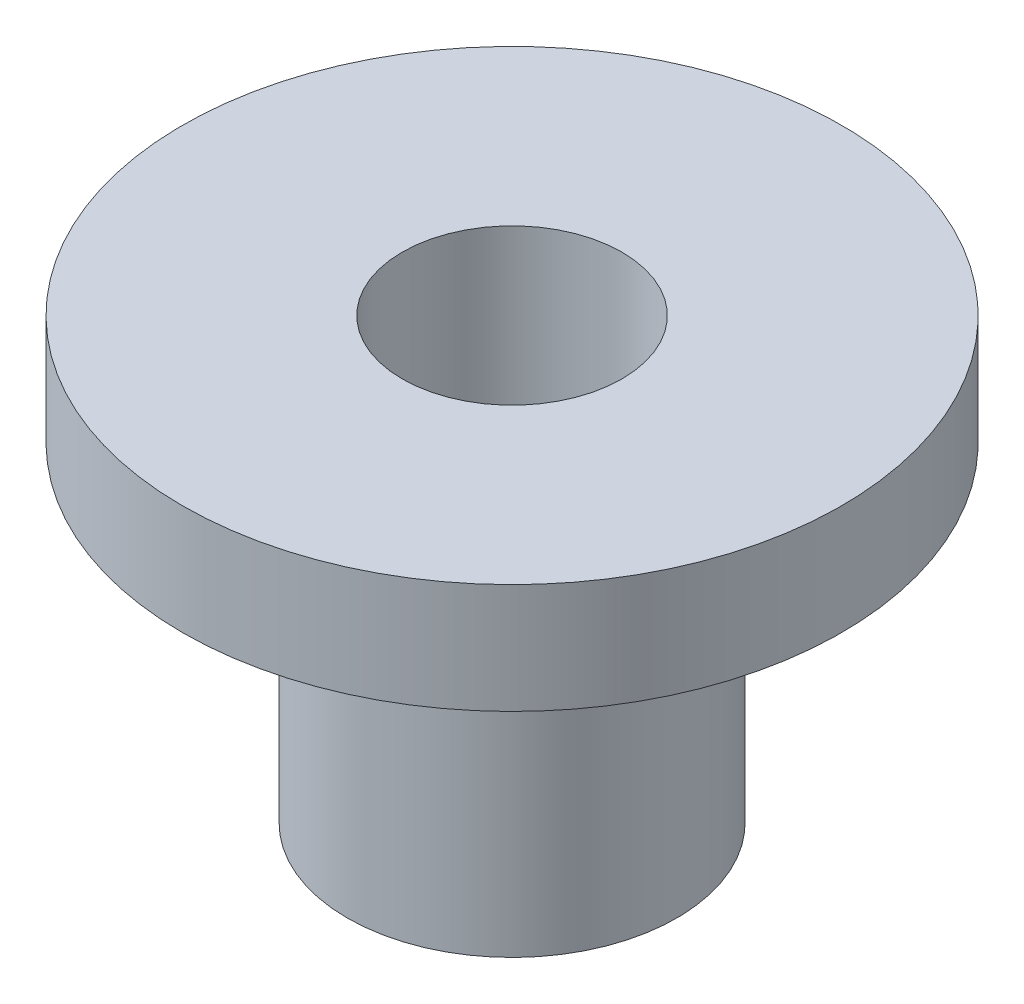
ISO-10303-21;
HEADER;
FILE_DESCRIPTION(('STEP AP214'),'2;1');
FILE_NAME('part.step','',(''),(''),'','','');
FILE_SCHEMA(('AUTOMOTIVE_DESIGN { 1 0 10303 214 1 1 1 1 }'));
ENDSEC;
DATA;
#1=APPLICATION_CONTEXT('core data for automotive mechanical design processes');
#2=APPLICATION_PROTOCOL_DEFINITION('international standard','automotive_design',2000,#1);
#3=PRODUCT_CONTEXT('',#1,'mechanical');
#4=PRODUCT('Part','Part','',(#3));
#5=PRODUCT_RELATED_PRODUCT_CATEGORY('part','',(#4));
#6=PRODUCT_DEFINITION_FORMATION('','',#4);
#7=PRODUCT_DEFINITION_CONTEXT('part definition',#1,'design');
#8=PRODUCT_DEFINITION('design','',#6,#7);
#9=PRODUCT_DEFINITION_SHAPE('','',#8);
#10=(LENGTH_UNIT() NAMED_UNIT(*) SI_UNIT(.MILLI.,.METRE.));
#11=(NAMED_UNIT(*) PLANE_ANGLE_UNIT() SI_UNIT($,.RADIAN.));
#12=(NAMED_UNIT(*) SI_UNIT($,.STERADIAN.) SOLID_ANGLE_UNIT());
#13=UNCERTAINTY_MEASURE_WITH_UNIT(LENGTH_MEASURE(1.E-05),#10,'distance_accuracy_value','');
#14=(GEOMETRIC_REPRESENTATION_CONTEXT(3) GLOBAL_UNCERTAINTY_ASSIGNED_CONTEXT((#13)) GLOBAL_UNIT_ASSIGNED_CONTEXT((#10,
#11,#12)) REPRESENTATION_CONTEXT('',''));
#15=CARTESIAN_POINT('',(0.,0.,0.));
#16=DIRECTION('',(0.,0.,1.));
#17=DIRECTION('',(1.,0.,0.));
#18=AXIS2_PLACEMENT_3D('',#15,#16,#17);
#19=CARTESIAN_POINT('',(0.,0.,0.));
#20=DIRECTION('',(0.,1.,0.));
#21=DIRECTION('',(0.,0.,1.));
#22=AXIS2_PLACEMENT_3D('',#19,#20,#21);
#23=CYLINDRICAL_SURFACE('',#22,9.525);
#24=CARTESIAN_POINT('',(0.,-3.175,0.));
#25=DIRECTION('',(0.,1.,0.));
#26=DIRECTION('',(0.,0.,1.));
#27=AXIS2_PLACEMENT_3D('',#24,#25,#26);
#28=CIRCLE('',#27,9.525);
#29=CARTESIAN_POINT('',(0.,-3.175,9.525));
#30=VERTEX_POINT('',#29);
#31=EDGE_CURVE('E10',#30,#30,#28,.T.);
#32=ORIENTED_EDGE('',*,*,#31,.T.);
#33=EDGE_LOOP('',(#32));
#34=FACE_BOUND('',#33,.T.);
#35=CARTESIAN_POINT('',(0.,0.,0.));
#36=DIRECTION('',(0.,1.,0.));
#37=DIRECTION('',(0.,0.,1.));
#38=AXIS2_PLACEMENT_3D('',#35,#36,#37);
#39=CIRCLE('',#38,9.525);
#40=CARTESIAN_POINT('',(0.,0.,9.525));
#41=VERTEX_POINT('',#40);
#42=EDGE_CURVE('E51',#41,#41,#39,.T.);
#43=ORIENTED_EDGE('',*,*,#42,.F.);
#44=EDGE_LOOP('',(#43));
#45=FACE_BOUND('',#44,.T.);
#46=ADVANCED_FACE('F29',(#34,#45),#23,.T.);
#47=CARTESIAN_POINT('',(-9.525,-3.175,0.));
#48=DIRECTION('',(0.,-1.,0.));
#49=DIRECTION('',(0.,0.,-1.));
#50=AXIS2_PLACEMENT_3D('',#47,#48,#49);
#51=PLANE('',#50);
#52=CARTESIAN_POINT('',(0.,-3.175,0.));
#53=DIRECTION('',(0.,1.,0.));
#54=DIRECTION('',(0.,0.,1.));
#55=AXIS2_PLACEMENT_3D('',#52,#53,#54);
#56=CIRCLE('',#55,4.7625);
#57=CARTESIAN_POINT('',(0.,-3.175,4.7625));
#58=VERTEX_POINT('',#57);
#59=EDGE_CURVE('E35',#58,#58,#56,.T.);
#60=ORIENTED_EDGE('',*,*,#59,.T.);
#61=EDGE_LOOP('',(#60));
#62=FACE_BOUND('',#61,.T.);
#63=ORIENTED_EDGE('',*,*,#31,.F.);
#64=EDGE_LOOP('',(#63));
#65=FACE_BOUND('',#64,.T.);
#66=ADVANCED_FACE('F59',(#62,#65),#51,.T.);
#67=CARTESIAN_POINT('',(0.,0.,0.));
#68=DIRECTION('',(0.,1.,0.));
#69=DIRECTION('',(0.,0.,1.));
#70=AXIS2_PLACEMENT_3D('',#67,#68,#69);
#71=CYLINDRICAL_SURFACE('',#70,4.7625);
#72=CARTESIAN_POINT('',(0.,-12.7,0.));
#73=DIRECTION('',(0.,1.,0.));
#74=DIRECTION('',(0.,0.,1.));
#75=AXIS2_PLACEMENT_3D('',#72,#73,#74);
#76=CIRCLE('',#75,4.7625);
#77=CARTESIAN_POINT('',(0.,-12.7,4.7625));
#78=VERTEX_POINT('',#77);
#79=EDGE_CURVE('E39',#78,#78,#76,.T.);
#80=ORIENTED_EDGE('',*,*,#79,.T.);
#81=EDGE_LOOP('',(#80));
#82=FACE_BOUND('',#81,.T.);
#83=ORIENTED_EDGE('',*,*,#59,.F.);
#84=EDGE_LOOP('',(#83));
#85=FACE_BOUND('',#84,.T.);
#86=ADVANCED_FACE('F63',(#82,#85),#71,.T.);
#87=CARTESIAN_POINT('',(-4.7625,-12.7,0.));
#88=DIRECTION('',(0.,-1.,0.));
#89=DIRECTION('',(0.,0.,-1.));
#90=AXIS2_PLACEMENT_3D('',#87,#88,#89);
#91=PLANE('',#90);
#92=CARTESIAN_POINT('',(0.,-12.7,0.));
#93=DIRECTION('',(0.,1.,0.));
#94=DIRECTION('',(0.,0.,1.));
#95=AXIS2_PLACEMENT_3D('',#92,#93,#94);
#96=CIRCLE('',#95,3.175);
#97=CARTESIAN_POINT('',(0.,-12.7,3.175));
#98=VERTEX_POINT('',#97);
#99=EDGE_CURVE('E43',#98,#98,#96,.T.);
#100=ORIENTED_EDGE('',*,*,#99,.T.);
#101=EDGE_LOOP('',(#100));
#102=FACE_BOUND('',#101,.T.);
#103=ORIENTED_EDGE('',*,*,#79,.F.);
#104=EDGE_LOOP('',(#103));
#105=FACE_BOUND('',#104,.T.);
#106=ADVANCED_FACE('F67',(#102,#105),#91,.T.);
#107=CARTESIAN_POINT('',(0.,0.,0.));
#108=DIRECTION('',(0.,1.,0.));
#109=DIRECTION('',(0.,0.,1.));
#110=AXIS2_PLACEMENT_3D('',#107,#108,#109);
#111=CYLINDRICAL_SURFACE('',#110,3.175);
#112=CARTESIAN_POINT('',(0.,0.,0.));
#113=DIRECTION('',(0.,1.,0.));
#114=DIRECTION('',(0.,0.,1.));
#115=AXIS2_PLACEMENT_3D('',#112,#113,#114);
#116=CIRCLE('',#115,3.175);
#117=CARTESIAN_POINT('',(0.,0.,3.175));
#118=VERTEX_POINT('',#117);
#119=EDGE_CURVE('E48',#118,#118,#116,.T.);
#120=ORIENTED_EDGE('',*,*,#119,.T.);
#121=EDGE_LOOP('',(#120));
#122=FACE_BOUND('',#121,.T.);
#123=ORIENTED_EDGE('',*,*,#99,.F.);
#124=EDGE_LOOP('',(#123));
#125=FACE_BOUND('',#124,.T.);
#126=ADVANCED_FACE('F74',(#122,#125),#111,.F.);
#127=CARTESIAN_POINT('',(-9.525,0.,0.));
#128=DIRECTION('',(0.,1.,0.));
#129=DIRECTION('',(0.,0.,1.));
#130=AXIS2_PLACEMENT_3D('',#127,#128,#129);
#131=PLANE('',#130);
#132=ORIENTED_EDGE('',*,*,#42,.T.);
#133=EDGE_LOOP('',(#132));
#134=FACE_BOUND('',#133,.T.);
#135=ORIENTED_EDGE('',*,*,#119,.F.);
#136=EDGE_LOOP('',(#135));
#137=FACE_BOUND('',#136,.T.);
#138=ADVANCED_FACE('F55',(#134,#137),#131,.T.);
#139=CLOSED_SHELL('',(#46,#66,#86,#106,#126,#138));
#140=MANIFOLD_SOLID_BREP('B2',#139);
#141=ADVANCED_BREP_SHAPE_REPRESENTATION('',(#18,#140),#14);
#142=SHAPE_DEFINITION_REPRESENTATION(#9,#141);
ENDSEC;
END-ISO-10303-21;
